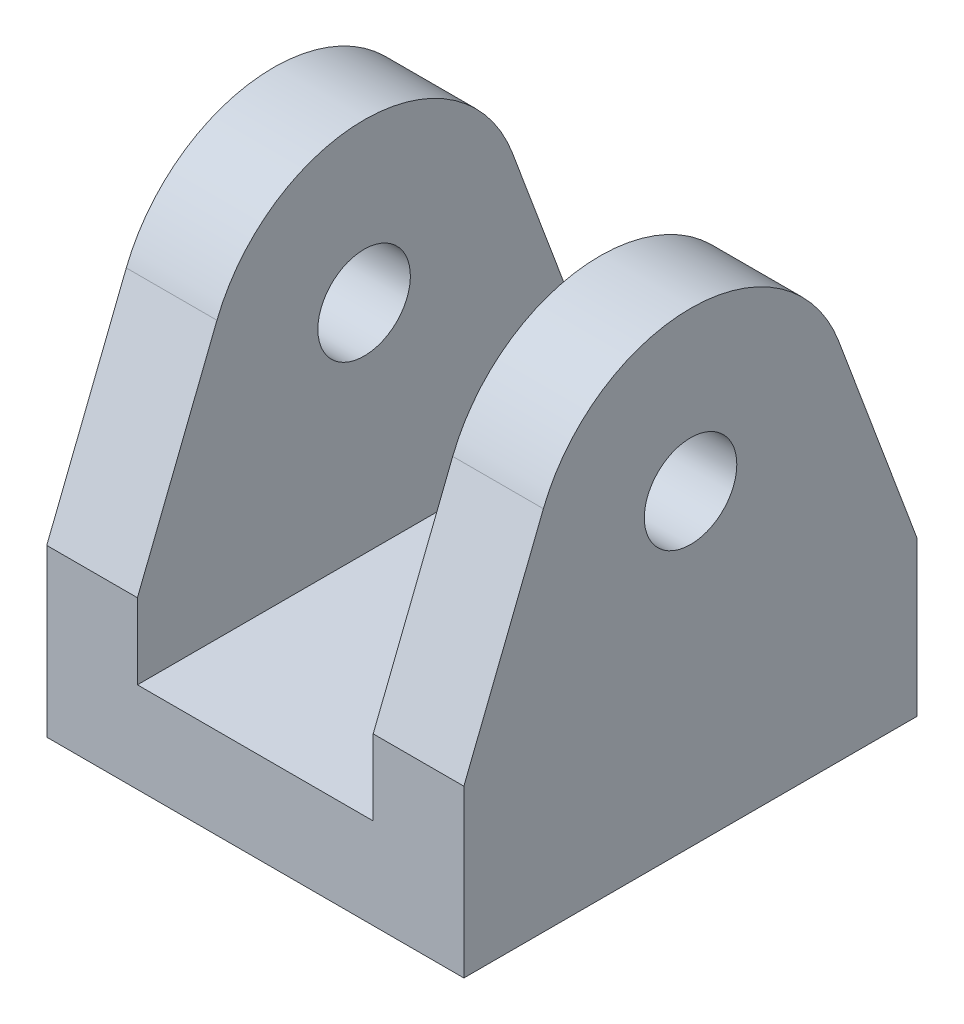
ISO-10303-21;
HEADER;
FILE_DESCRIPTION(('STEP AP214'),'2;1');
FILE_NAME('part.step','',(''),(''),'','','');
FILE_SCHEMA(('AUTOMOTIVE_DESIGN { 1 0 10303 214 1 1 1 1 }'));
ENDSEC;
DATA;
#1=APPLICATION_CONTEXT('core data for automotive mechanical design processes');
#2=APPLICATION_PROTOCOL_DEFINITION('international standard','automotive_design',2000,#1);
#3=PRODUCT_CONTEXT('',#1,'mechanical');
#4=PRODUCT('Part','Part','',(#3));
#5=PRODUCT_RELATED_PRODUCT_CATEGORY('part','',(#4));
#6=PRODUCT_DEFINITION_FORMATION('','',#4);
#7=PRODUCT_DEFINITION_CONTEXT('part definition',#1,'design');
#8=PRODUCT_DEFINITION('design','',#6,#7);
#9=PRODUCT_DEFINITION_SHAPE('','',#8);
#10=(LENGTH_UNIT() NAMED_UNIT(*) SI_UNIT(.MILLI.,.METRE.));
#11=(NAMED_UNIT(*) PLANE_ANGLE_UNIT() SI_UNIT($,.RADIAN.));
#12=(NAMED_UNIT(*) SI_UNIT($,.STERADIAN.) SOLID_ANGLE_UNIT());
#13=UNCERTAINTY_MEASURE_WITH_UNIT(LENGTH_MEASURE(1.E-05),#10,'distance_accuracy_value','');
#14=(GEOMETRIC_REPRESENTATION_CONTEXT(3) GLOBAL_UNCERTAINTY_ASSIGNED_CONTEXT((#13)) GLOBAL_UNIT_ASSIGNED_CONTEXT((#10,
#11,#12)) REPRESENTATION_CONTEXT('',''));
#15=CARTESIAN_POINT('',(0.,0.,0.));
#16=DIRECTION('',(0.,0.,1.));
#17=DIRECTION('',(1.,0.,0.));
#18=AXIS2_PLACEMENT_3D('',#15,#16,#17);
#19=CARTESIAN_POINT('',(6.5,5.,12.5));
#20=DIRECTION('',(1.,0.,0.));
#21=DIRECTION('',(0.,0.,-1.));
#22=AXIS2_PLACEMENT_3D('',#19,#20,#21);
#23=PLANE('',#22);
#24=CARTESIAN_POINT('',(6.5,17.,0.));
#25=DIRECTION('',(1.,0.,0.));
#26=DIRECTION('',(0.,0.,-1.));
#27=AXIS2_PLACEMENT_3D('',#24,#25,#26);
#28=CIRCLE('',#27,2.55);
#29=CARTESIAN_POINT('',(6.5,17.,-2.55));
#30=VERTEX_POINT('',#29);
#31=EDGE_CURVE('E233',#30,#30,#28,.T.);
#32=ORIENTED_EDGE('',*,*,#31,.T.);
#33=EDGE_LOOP('',(#32));
#34=FACE_BOUND('',#33,.T.);
#35=CARTESIAN_POINT('',(6.5,17.,0.));
#36=DIRECTION('',(1.,0.,0.));
#37=DIRECTION('',(0.,0.,-1.));
#38=AXIS2_PLACEMENT_3D('',#35,#36,#37);
#39=CIRCLE('',#38,8.72992700729924);
#40=CARTESIAN_POINT('',(6.5,20.2177618657102,8.11527166078586));
#41=VERTEX_POINT('',#40);
#42=CARTESIAN_POINT('',(6.5,20.0550867906984,-8.17790133555502));
#43=VERTEX_POINT('',#42);
#44=EDGE_CURVE('E258',#41,#43,#39,.F.);
#45=ORIENTED_EDGE('',*,*,#44,.T.);
#46=DIRECTION('',(0.,-0.936766290109566,-0.3499555939178));
#47=VECTOR('',#46,1.);
#48=CARTESIAN_POINT('',(6.5,13.6225463459891,-10.5809591051351));
#49=LINE('',#48,#47);
#50=CARTESIAN_POINT('',(6.5,8.48562940311158,-12.5));
#51=VERTEX_POINT('',#50);
#52=EDGE_CURVE('E221',#43,#51,#49,.T.);
#53=ORIENTED_EDGE('',*,*,#52,.T.);
#54=DIRECTION('',(0.,-1.,0.));
#55=VECTOR('',#54,1.);
#56=CARTESIAN_POINT('',(6.5,5.,-12.5));
#57=LINE('',#56,#55);
#58=CARTESIAN_POINT('',(6.5,5.,-12.5));
#59=VERTEX_POINT('',#58);
#60=EDGE_CURVE('E261',#51,#59,#57,.T.);
#61=ORIENTED_EDGE('',*,*,#60,.T.);
#62=DIRECTION('',(0.,0.,-1.));
#63=VECTOR('',#62,1.);
#64=CARTESIAN_POINT('',(6.5,5.,12.5));
#65=LINE('',#64,#63);
#66=CARTESIAN_POINT('',(6.5,5.,12.5));
#67=VERTEX_POINT('',#66);
#68=EDGE_CURVE('E312',#67,#59,#65,.T.);
#69=ORIENTED_EDGE('',*,*,#68,.F.);
#70=DIRECTION('',(0.,-1.,0.));
#71=VECTOR('',#70,1.);
#72=CARTESIAN_POINT('',(6.5,5.,12.5));
#73=LINE('',#72,#71);
#74=CARTESIAN_POINT('',(6.5,9.15937311088666,12.5));
#75=VERTEX_POINT('',#74);
#76=EDGE_CURVE('E262',#75,#67,#73,.T.);
#77=ORIENTED_EDGE('',*,*,#76,.F.);
#78=DIRECTION('',(0.,0.929592155123467,-0.368589778931684));
#79=VECTOR('',#78,1.);
#80=CARTESIAN_POINT('',(6.5,5.56508588038522,13.9251599783902));
#81=LINE('',#80,#79);
#82=EDGE_CURVE('E99',#75,#41,#81,.T.);
#83=ORIENTED_EDGE('',*,*,#82,.T.);
#84=EDGE_LOOP('',(#45,#53,#61,#69,#77,#83));
#85=FACE_BOUND('',#84,.T.);
#86=ADVANCED_FACE('F69',(#34,#85),#23,.F.);
#87=CARTESIAN_POINT('',(-6.5,5.,12.5));
#88=DIRECTION('',(-1.,0.,0.));
#89=DIRECTION('',(0.,0.,1.));
#90=AXIS2_PLACEMENT_3D('',#87,#88,#89);
#91=PLANE('',#90);
#92=CARTESIAN_POINT('',(-6.5,17.,0.));
#93=DIRECTION('',(-1.,0.,0.));
#94=DIRECTION('',(0.,0.,1.));
#95=AXIS2_PLACEMENT_3D('',#92,#93,#94);
#96=CIRCLE('',#95,2.55);
#97=CARTESIAN_POINT('',(-6.5,17.,2.55));
#98=VERTEX_POINT('',#97);
#99=EDGE_CURVE('E229',#98,#98,#96,.T.);
#100=ORIENTED_EDGE('',*,*,#99,.T.);
#101=EDGE_LOOP('',(#100));
#102=FACE_BOUND('',#101,.T.);
#103=DIRECTION('',(0.,1.,0.));
#104=VECTOR('',#103,1.);
#105=CARTESIAN_POINT('',(-6.5,5.,-12.5));
#106=LINE('',#105,#104);
#107=CARTESIAN_POINT('',(-6.5,5.,-12.5));
#108=VERTEX_POINT('',#107);
#109=CARTESIAN_POINT('',(-6.5,8.48562940311158,-12.5));
#110=VERTEX_POINT('',#109);
#111=EDGE_CURVE('E289',#108,#110,#106,.T.);
#112=ORIENTED_EDGE('',*,*,#111,.T.);
#113=DIRECTION('',(0.,0.936766290109566,0.3499555939178));
#114=VECTOR('',#113,1.);
#115=CARTESIAN_POINT('',(-6.5,13.6225463459891,-10.5809591051351));
#116=LINE('',#115,#114);
#117=CARTESIAN_POINT('',(-6.5,20.0550867906984,-8.17790133555502));
#118=VERTEX_POINT('',#117);
#119=EDGE_CURVE('E203',#110,#118,#116,.T.);
#120=ORIENTED_EDGE('',*,*,#119,.T.);
#121=CARTESIAN_POINT('',(-6.5,17.,0.));
#122=DIRECTION('',(-1.,0.,0.));
#123=DIRECTION('',(0.,0.,1.));
#124=AXIS2_PLACEMENT_3D('',#121,#122,#123);
#125=CIRCLE('',#124,8.72992700729924);
#126=CARTESIAN_POINT('',(-6.5,20.2177618657102,8.11527166078586));
#127=VERTEX_POINT('',#126);
#128=EDGE_CURVE('E193',#118,#127,#125,.F.);
#129=ORIENTED_EDGE('',*,*,#128,.T.);
#130=DIRECTION('',(0.,-0.929592155123467,0.368589778931684));
#131=VECTOR('',#130,1.);
#132=CARTESIAN_POINT('',(-6.5,5.56508588038522,13.9251599783902));
#133=LINE('',#132,#131);
#134=CARTESIAN_POINT('',(-6.5,9.15937311088666,12.5));
#135=VERTEX_POINT('',#134);
#136=EDGE_CURVE('E248',#127,#135,#133,.T.);
#137=ORIENTED_EDGE('',*,*,#136,.T.);
#138=DIRECTION('',(0.,1.,0.));
#139=VECTOR('',#138,1.);
#140=CARTESIAN_POINT('',(-6.5,5.,12.5));
#141=LINE('',#140,#139);
#142=CARTESIAN_POINT('',(-6.5,5.,12.5));
#143=VERTEX_POINT('',#142);
#144=EDGE_CURVE('E269',#143,#135,#141,.T.);
#145=ORIENTED_EDGE('',*,*,#144,.F.);
#146=DIRECTION('',(0.,0.,-1.));
#147=VECTOR('',#146,1.);
#148=CARTESIAN_POINT('',(-6.5,5.,12.5));
#149=LINE('',#148,#147);
#150=EDGE_CURVE('E308',#143,#108,#149,.T.);
#151=ORIENTED_EDGE('',*,*,#150,.T.);
#152=EDGE_LOOP('',(#112,#120,#129,#137,#145,#151));
#153=FACE_BOUND('',#152,.T.);
#154=ADVANCED_FACE('F335',(#102,#153),#91,.F.);
#155=CARTESIAN_POINT('',(-11.5,25.7299270072992,12.5));
#156=DIRECTION('',(1.,0.,0.));
#157=DIRECTION('',(0.,1.,0.));
#158=AXIS2_PLACEMENT_3D('',#155,#156,#157);
#159=PLANE('',#158);
#160=CARTESIAN_POINT('',(-11.5,17.,0.));
#161=DIRECTION('',(1.,0.,0.));
#162=DIRECTION('',(0.,1.,0.));
#163=AXIS2_PLACEMENT_3D('',#160,#161,#162);
#164=CIRCLE('',#163,2.55);
#165=CARTESIAN_POINT('',(-11.5,19.55,0.));
#166=VERTEX_POINT('',#165);
#167=EDGE_CURVE('E225',#166,#166,#164,.T.);
#168=ORIENTED_EDGE('',*,*,#167,.T.);
#169=EDGE_LOOP('',(#168));
#170=FACE_BOUND('',#169,.T.);
#171=CARTESIAN_POINT('',(-11.5,17.,0.));
#172=DIRECTION('',(1.,0.,0.));
#173=DIRECTION('',(0.,1.,0.));
#174=AXIS2_PLACEMENT_3D('',#171,#172,#173);
#175=CIRCLE('',#174,8.72992700729924);
#176=CARTESIAN_POINT('',(-11.5,20.2177618657102,8.11527166078586));
#177=VERTEX_POINT('',#176);
#178=CARTESIAN_POINT('',(-11.5,20.0550867906984,-8.17790133555502));
#179=VERTEX_POINT('',#178);
#180=EDGE_CURVE('E183',#177,#179,#175,.F.);
#181=ORIENTED_EDGE('',*,*,#180,.T.);
#182=DIRECTION('',(0.,-0.936766290109566,-0.3499555939178));
#183=VECTOR('',#182,1.);
#184=CARTESIAN_POINT('',(-11.5,31.8137016284067,-3.78513754524019));
#185=LINE('',#184,#183);
#186=CARTESIAN_POINT('',(-11.5,8.48562940311158,-12.5));
#187=VERTEX_POINT('',#186);
#188=EDGE_CURVE('E186',#179,#187,#185,.T.);
#189=ORIENTED_EDGE('',*,*,#188,.T.);
#190=DIRECTION('',(0.,-1.,0.));
#191=VECTOR('',#190,1.);
#192=CARTESIAN_POINT('',(-11.5,25.7299270072992,-12.5));
#193=LINE('',#192,#191);
#194=CARTESIAN_POINT('',(-11.5,0.,-12.5));
#195=VERTEX_POINT('',#194);
#196=EDGE_CURVE('E293',#187,#195,#193,.T.);
#197=ORIENTED_EDGE('',*,*,#196,.T.);
#198=DIRECTION('',(0.,0.,-1.));
#199=VECTOR('',#198,1.);
#200=CARTESIAN_POINT('',(-11.5,0.,12.5));
#201=LINE('',#200,#199);
#202=CARTESIAN_POINT('',(-11.5,0.,12.5));
#203=VERTEX_POINT('',#202);
#204=EDGE_CURVE('E305',#203,#195,#201,.T.);
#205=ORIENTED_EDGE('',*,*,#204,.F.);
#206=DIRECTION('',(0.,-1.,0.));
#207=VECTOR('',#206,1.);
#208=CARTESIAN_POINT('',(-11.5,25.7299270072992,12.5));
#209=LINE('',#208,#207);
#210=CARTESIAN_POINT('',(-11.5,9.15937311088666,12.5));
#211=VERTEX_POINT('',#210);
#212=EDGE_CURVE('E273',#211,#203,#209,.T.);
#213=ORIENTED_EDGE('',*,*,#212,.F.);
#214=DIRECTION('',(0.,0.929592155123467,-0.368589778931684));
#215=VECTOR('',#214,1.);
#216=CARTESIAN_POINT('',(-11.5,23.4786776513527,6.82229578752758));
#217=LINE('',#216,#215);
#218=EDGE_CURVE('E88',#211,#177,#217,.T.);
#219=ORIENTED_EDGE('',*,*,#218,.T.);
#220=EDGE_LOOP('',(#181,#189,#197,#205,#213,#219));
#221=FACE_BOUND('',#220,.T.);
#222=ADVANCED_FACE('F185',(#170,#221),#159,.F.);
#223=CARTESIAN_POINT('',(11.5,25.7299270072992,12.5));
#224=DIRECTION('',(-1.,0.,0.));
#225=DIRECTION('',(0.,-1.,0.));
#226=AXIS2_PLACEMENT_3D('',#223,#224,#225);
#227=PLANE('',#226);
#228=CARTESIAN_POINT('',(11.5,17.,0.));
#229=DIRECTION('',(-1.,0.,0.));
#230=DIRECTION('',(0.,-1.,0.));
#231=AXIS2_PLACEMENT_3D('',#228,#229,#230);
#232=CIRCLE('',#231,2.55);
#233=CARTESIAN_POINT('',(11.5,14.45,0.));
#234=VERTEX_POINT('',#233);
#235=EDGE_CURVE('E72',#234,#234,#232,.T.);
#236=ORIENTED_EDGE('',*,*,#235,.T.);
#237=EDGE_LOOP('',(#236));
#238=FACE_BOUND('',#237,.T.);
#239=DIRECTION('',(0.,1.,0.));
#240=VECTOR('',#239,1.);
#241=CARTESIAN_POINT('',(11.5,25.7299270072992,-12.5));
#242=LINE('',#241,#240);
#243=CARTESIAN_POINT('',(11.5,0.,-12.5));
#244=VERTEX_POINT('',#243);
#245=CARTESIAN_POINT('',(11.5,8.48562940311158,-12.5));
#246=VERTEX_POINT('',#245);
#247=EDGE_CURVE('E266',#244,#246,#242,.T.);
#248=ORIENTED_EDGE('',*,*,#247,.T.);
#249=DIRECTION('',(0.,0.936766290109566,0.3499555939178));
#250=VECTOR('',#249,1.);
#251=CARTESIAN_POINT('',(11.5,31.8137016284067,-3.78513754524019));
#252=LINE('',#251,#250);
#253=CARTESIAN_POINT('',(11.5,20.0550867906984,-8.17790133555502));
#254=VERTEX_POINT('',#253);
#255=EDGE_CURVE('E204',#246,#254,#252,.T.);
#256=ORIENTED_EDGE('',*,*,#255,.T.);
#257=CARTESIAN_POINT('',(11.5,17.,0.));
#258=DIRECTION('',(-1.,0.,0.));
#259=DIRECTION('',(0.,-1.,0.));
#260=AXIS2_PLACEMENT_3D('',#257,#258,#259);
#261=CIRCLE('',#260,8.72992700729924);
#262=CARTESIAN_POINT('',(11.5,20.2177618657102,8.11527166078586));
#263=VERTEX_POINT('',#262);
#264=EDGE_CURVE('E194',#254,#263,#261,.F.);
#265=ORIENTED_EDGE('',*,*,#264,.T.);
#266=DIRECTION('',(0.,-0.929592155123467,0.368589778931684));
#267=VECTOR('',#266,1.);
#268=CARTESIAN_POINT('',(11.5,23.4786776513527,6.82229578752758));
#269=LINE('',#268,#267);
#270=CARTESIAN_POINT('',(11.5,9.15937311088666,12.5));
#271=VERTEX_POINT('',#270);
#272=EDGE_CURVE('E242',#263,#271,#269,.T.);
#273=ORIENTED_EDGE('',*,*,#272,.T.);
#274=DIRECTION('',(0.,1.,0.));
#275=VECTOR('',#274,1.);
#276=CARTESIAN_POINT('',(11.5,25.7299270072992,12.5));
#277=LINE('',#276,#275);
#278=CARTESIAN_POINT('',(11.5,0.,12.5));
#279=VERTEX_POINT('',#278);
#280=EDGE_CURVE('E279',#279,#271,#277,.T.);
#281=ORIENTED_EDGE('',*,*,#280,.F.);
#282=DIRECTION('',(0.,0.,-1.));
#283=VECTOR('',#282,1.);
#284=CARTESIAN_POINT('',(11.5,0.,12.5));
#285=LINE('',#284,#283);
#286=EDGE_CURVE('E283',#279,#244,#285,.T.);
#287=ORIENTED_EDGE('',*,*,#286,.T.);
#288=EDGE_LOOP('',(#248,#256,#265,#273,#281,#287));
#289=FACE_BOUND('',#288,.T.);
#290=ADVANCED_FACE('F381',(#238,#289),#227,.F.);
#291=CARTESIAN_POINT('',(-6.5,5.,12.5));
#292=DIRECTION('',(0.,-1.,0.));
#293=DIRECTION('',(0.,0.,-1.));
#294=AXIS2_PLACEMENT_3D('',#291,#292,#293);
#295=PLANE('',#294);
#296=DIRECTION('',(-1.,0.,0.));
#297=VECTOR('',#296,1.);
#298=CARTESIAN_POINT('',(-6.5,5.,-12.5));
#299=LINE('',#298,#297);
#300=EDGE_CURVE('E286',#59,#108,#299,.T.);
#301=ORIENTED_EDGE('',*,*,#300,.T.);
#302=ORIENTED_EDGE('',*,*,#150,.F.);
#303=DIRECTION('',(-1.,0.,0.));
#304=VECTOR('',#303,1.);
#305=CARTESIAN_POINT('',(-6.5,5.,12.5));
#306=LINE('',#305,#304);
#307=EDGE_CURVE('E265',#67,#143,#306,.T.);
#308=ORIENTED_EDGE('',*,*,#307,.F.);
#309=ORIENTED_EDGE('',*,*,#68,.T.);
#310=EDGE_LOOP('',(#301,#302,#308,#309));
#311=FACE_BOUND('',#310,.T.);
#312=ADVANCED_FACE('F331',(#311),#295,.F.);
#313=CARTESIAN_POINT('',(11.5,0.,12.5));
#314=DIRECTION('',(0.,1.,0.));
#315=DIRECTION('',(0.,0.,1.));
#316=AXIS2_PLACEMENT_3D('',#313,#314,#315);
#317=PLANE('',#316);
#318=DIRECTION('',(1.,0.,0.));
#319=VECTOR('',#318,1.);
#320=CARTESIAN_POINT('',(11.5,0.,-12.5));
#321=LINE('',#320,#319);
#322=EDGE_CURVE('E296',#195,#244,#321,.T.);
#323=ORIENTED_EDGE('',*,*,#322,.T.);
#324=ORIENTED_EDGE('',*,*,#286,.F.);
#325=DIRECTION('',(1.,0.,0.));
#326=VECTOR('',#325,1.);
#327=CARTESIAN_POINT('',(11.5,0.,12.5));
#328=LINE('',#327,#326);
#329=EDGE_CURVE('E276',#203,#279,#328,.T.);
#330=ORIENTED_EDGE('',*,*,#329,.F.);
#331=ORIENTED_EDGE('',*,*,#204,.T.);
#332=EDGE_LOOP('',(#323,#324,#330,#331));
#333=FACE_BOUND('',#332,.T.);
#334=ADVANCED_FACE('F390',(#333),#317,.F.);
#335=CARTESIAN_POINT('',(0.,0.,12.5));
#336=DIRECTION('',(0.,0.,-1.));
#337=DIRECTION('',(-1.,0.,0.));
#338=AXIS2_PLACEMENT_3D('',#335,#336,#337);
#339=PLANE('',#338);
#340=ORIENTED_EDGE('',*,*,#280,.T.);
#341=DIRECTION('',(-1.,0.,0.));
#342=VECTOR('',#341,1.);
#343=CARTESIAN_POINT('',(0.,9.15937311088666,12.5));
#344=LINE('',#343,#342);
#345=EDGE_CURVE('E318',#271,#75,#344,.T.);
#346=ORIENTED_EDGE('',*,*,#345,.T.);
#347=ORIENTED_EDGE('',*,*,#76,.T.);
#348=ORIENTED_EDGE('',*,*,#307,.T.);
#349=ORIENTED_EDGE('',*,*,#144,.T.);
#350=EDGE_CURVE('E316',#135,#211,#344,.T.);
#351=ORIENTED_EDGE('',*,*,#350,.T.);
#352=ORIENTED_EDGE('',*,*,#212,.T.);
#353=ORIENTED_EDGE('',*,*,#329,.T.);
#354=EDGE_LOOP('',(#340,#346,#347,#348,#349,#351,#352,#353));
#355=FACE_BOUND('',#354,.T.);
#356=ADVANCED_FACE('F323',(#355),#339,.F.);
#357=CARTESIAN_POINT('',(0.,0.,-12.5));
#358=DIRECTION('',(0.,0.,-1.));
#359=DIRECTION('',(-1.,0.,0.));
#360=AXIS2_PLACEMENT_3D('',#357,#358,#359);
#361=PLANE('',#360);
#362=DIRECTION('',(-1.,0.,0.));
#363=VECTOR('',#362,1.);
#364=CARTESIAN_POINT('',(0.,8.48562940311157,-12.5));
#365=LINE('',#364,#363);
#366=EDGE_CURVE('E12',#246,#51,#365,.T.);
#367=ORIENTED_EDGE('',*,*,#366,.F.);
#368=ORIENTED_EDGE('',*,*,#247,.F.);
#369=ORIENTED_EDGE('',*,*,#322,.F.);
#370=ORIENTED_EDGE('',*,*,#196,.F.);
#371=EDGE_CURVE('E78',#110,#187,#365,.T.);
#372=ORIENTED_EDGE('',*,*,#371,.F.);
#373=ORIENTED_EDGE('',*,*,#111,.F.);
#374=ORIENTED_EDGE('',*,*,#300,.F.);
#375=ORIENTED_EDGE('',*,*,#60,.F.);
#376=EDGE_LOOP('',(#367,#368,#369,#370,#372,#373,#374,#375));
#377=FACE_BOUND('',#376,.T.);
#378=ADVANCED_FACE('F340',(#377),#361,.T.);
#379=CARTESIAN_POINT('',(-21.5,5.52735509296959,13.9401204989968));
#380=DIRECTION('',(0.,-0.368589778931684,-0.929592155123467));
#381=DIRECTION('',(0.,0.929592155123467,-0.368589778931684));
#382=AXIS2_PLACEMENT_3D('',#379,#380,#381);
#383=PLANE('',#382);
#384=DIRECTION('',(1.,0.,0.));
#385=VECTOR('',#384,1.);
#386=CARTESIAN_POINT('',(-21.5,20.2177618657102,8.11527166078586));
#387=LINE('',#386,#385);
#388=EDGE_CURVE('E241',#177,#127,#387,.T.);
#389=ORIENTED_EDGE('',*,*,#388,.F.);
#390=ORIENTED_EDGE('',*,*,#218,.F.);
#391=ORIENTED_EDGE('',*,*,#350,.F.);
#392=ORIENTED_EDGE('',*,*,#136,.F.);
#393=EDGE_LOOP('',(#389,#390,#391,#392));
#394=FACE_BOUND('',#393,.T.);
#395=ADVANCED_FACE('F337',(#394),#383,.F.);
#396=CARTESIAN_POINT('',(-21.5,17.,0.));
#397=DIRECTION('',(1.,0.,0.));
#398=DIRECTION('',(0.,0.,-1.));
#399=AXIS2_PLACEMENT_3D('',#396,#397,#398);
#400=CYLINDRICAL_SURFACE('',#399,8.72992700729924);
#401=ORIENTED_EDGE('',*,*,#128,.F.);
#402=DIRECTION('',(1.,0.,0.));
#403=VECTOR('',#402,1.);
#404=CARTESIAN_POINT('',(-21.5,20.0550867906984,-8.17790133555502));
#405=LINE('',#404,#403);
#406=EDGE_CURVE('E199',#179,#118,#405,.T.);
#407=ORIENTED_EDGE('',*,*,#406,.F.);
#408=ORIENTED_EDGE('',*,*,#180,.F.);
#409=ORIENTED_EDGE('',*,*,#388,.T.);
#410=EDGE_LOOP('',(#401,#407,#408,#409));
#411=FACE_BOUND('',#410,.T.);
#412=ADVANCED_FACE('F206',(#411),#400,.T.);
#413=EDGE_CURVE('E237',#41,#263,#387,.T.);
#414=ORIENTED_EDGE('',*,*,#413,.T.);
#415=ORIENTED_EDGE('',*,*,#264,.F.);
#416=EDGE_CURVE('E209',#43,#254,#405,.T.);
#417=ORIENTED_EDGE('',*,*,#416,.F.);
#418=ORIENTED_EDGE('',*,*,#44,.F.);
#419=EDGE_LOOP('',(#414,#415,#417,#418));
#420=FACE_BOUND('',#419,.T.);
#421=ADVANCED_FACE('F347',(#420),#400,.T.);
#422=ORIENTED_EDGE('',*,*,#345,.F.);
#423=ORIENTED_EDGE('',*,*,#272,.F.);
#424=ORIENTED_EDGE('',*,*,#413,.F.);
#425=ORIENTED_EDGE('',*,*,#82,.F.);
#426=EDGE_LOOP('',(#422,#423,#424,#425));
#427=FACE_BOUND('',#426,.T.);
#428=ADVANCED_FACE('F342',(#427),#383,.F.);
#429=CARTESIAN_POINT('',(-21.5,5.13705839184256,-13.750953593652));
#430=DIRECTION('',(0.,-0.3499555939178,0.936766290109566));
#431=DIRECTION('',(0.,-0.936766290109566,-0.3499555939178));
#432=AXIS2_PLACEMENT_3D('',#429,#430,#431);
#433=PLANE('',#432);
#434=ORIENTED_EDGE('',*,*,#416,.T.);
#435=ORIENTED_EDGE('',*,*,#255,.F.);
#436=ORIENTED_EDGE('',*,*,#366,.T.);
#437=ORIENTED_EDGE('',*,*,#52,.F.);
#438=EDGE_LOOP('',(#434,#435,#436,#437));
#439=FACE_BOUND('',#438,.T.);
#440=ADVANCED_FACE('F353',(#439),#433,.F.);
#441=ORIENTED_EDGE('',*,*,#371,.T.);
#442=ORIENTED_EDGE('',*,*,#188,.F.);
#443=ORIENTED_EDGE('',*,*,#406,.T.);
#444=ORIENTED_EDGE('',*,*,#119,.F.);
#445=EDGE_LOOP('',(#441,#442,#443,#444));
#446=FACE_BOUND('',#445,.T.);
#447=ADVANCED_FACE('F198',(#446),#433,.F.);
#448=CARTESIAN_POINT('',(-21.5,17.,0.));
#449=DIRECTION('',(1.,0.,0.));
#450=DIRECTION('',(0.,0.,-1.));
#451=AXIS2_PLACEMENT_3D('',#448,#449,#450);
#452=CYLINDRICAL_SURFACE('',#451,2.55);
#453=ORIENTED_EDGE('',*,*,#235,.F.);
#454=EDGE_LOOP('',(#453));
#455=FACE_BOUND('',#454,.T.);
#456=ORIENTED_EDGE('',*,*,#31,.F.);
#457=EDGE_LOOP('',(#456));
#458=FACE_BOUND('',#457,.T.);
#459=ADVANCED_FACE('F363',(#455,#458),#452,.F.);
#460=ORIENTED_EDGE('',*,*,#167,.F.);
#461=EDGE_LOOP('',(#460));
#462=FACE_BOUND('',#461,.T.);
#463=ORIENTED_EDGE('',*,*,#99,.F.);
#464=EDGE_LOOP('',(#463));
#465=FACE_BOUND('',#464,.T.);
#466=ADVANCED_FACE('F365',(#462,#465),#452,.F.);
#467=CLOSED_SHELL('',(#86,#154,#222,#290,#312,#334,#356,#378,#395,#412,#421,#428,#440,#447,#459,#466));
#468=MANIFOLD_SOLID_BREP('B2',#467);
#469=ADVANCED_BREP_SHAPE_REPRESENTATION('',(#18,#468),#14);
#470=SHAPE_DEFINITION_REPRESENTATION(#9,#469);
ENDSEC;
END-ISO-10303-21;
